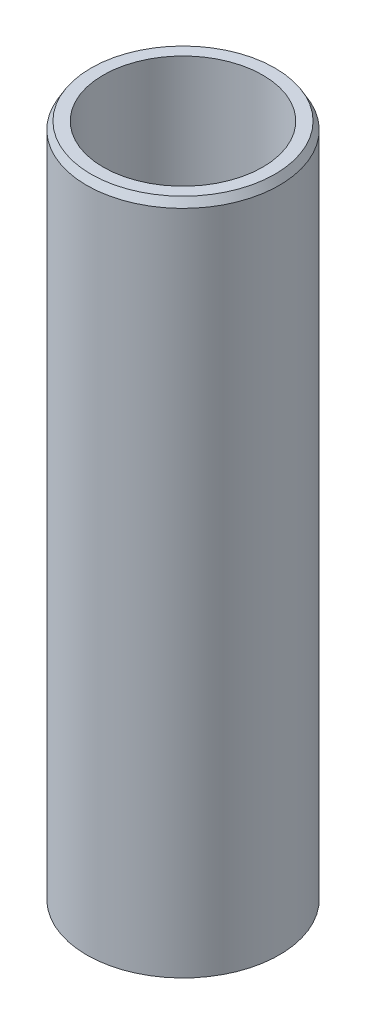
ISO-10303-21;
HEADER;
FILE_DESCRIPTION(('STEP AP214'),'2;1');
FILE_NAME('part.step','',(''),(''),'','','');
FILE_SCHEMA(('AUTOMOTIVE_DESIGN { 1 0 10303 214 1 1 1 1 }'));
ENDSEC;
DATA;
#1=APPLICATION_CONTEXT('core data for automotive mechanical design processes');
#2=APPLICATION_PROTOCOL_DEFINITION('international standard','automotive_design',2000,#1);
#3=PRODUCT_CONTEXT('',#1,'mechanical');
#4=PRODUCT('Part','Part','',(#3));
#5=PRODUCT_RELATED_PRODUCT_CATEGORY('part','',(#4));
#6=PRODUCT_DEFINITION_FORMATION('','',#4);
#7=PRODUCT_DEFINITION_CONTEXT('part definition',#1,'design');
#8=PRODUCT_DEFINITION('design','',#6,#7);
#9=PRODUCT_DEFINITION_SHAPE('','',#8);
#10=(LENGTH_UNIT() NAMED_UNIT(*) SI_UNIT(.MILLI.,.METRE.));
#11=(NAMED_UNIT(*) PLANE_ANGLE_UNIT() SI_UNIT($,.RADIAN.));
#12=(NAMED_UNIT(*) SI_UNIT($,.STERADIAN.) SOLID_ANGLE_UNIT());
#13=UNCERTAINTY_MEASURE_WITH_UNIT(LENGTH_MEASURE(1.E-05),#10,'distance_accuracy_value','');
#14=(GEOMETRIC_REPRESENTATION_CONTEXT(3) GLOBAL_UNCERTAINTY_ASSIGNED_CONTEXT((#13)) GLOBAL_UNIT_ASSIGNED_CONTEXT((#10,
#11,#12)) REPRESENTATION_CONTEXT('',''));
#15=CARTESIAN_POINT('',(0.,0.,0.));
#16=DIRECTION('',(0.,0.,1.));
#17=DIRECTION('',(1.,0.,0.));
#18=AXIS2_PLACEMENT_3D('',#15,#16,#17);
#19=CARTESIAN_POINT('',(0.,404.954098009164,0.));
#20=DIRECTION('',(0.,-1.,0.));
#21=DIRECTION('',(0.,0.,-1.));
#22=AXIS2_PLACEMENT_3D('',#19,#20,#21);
#23=CYLINDRICAL_SURFACE('',#22,57.5);
#24=CARTESIAN_POINT('',(0.,400.478846971104,0.));
#25=DIRECTION('',(0.,1.,0.));
#26=DIRECTION('',(0.,0.,1.));
#27=AXIS2_PLACEMENT_3D('',#24,#25,#26);
#28=CIRCLE('',#27,57.5);
#29=CARTESIAN_POINT('',(0.,400.478846971104,57.5));
#30=VERTEX_POINT('',#29);
#31=EDGE_CURVE('E50',#30,#30,#28,.F.);
#32=ORIENTED_EDGE('',*,*,#31,.T.);
#33=EDGE_LOOP('',(#32));
#34=FACE_BOUND('',#33,.T.);
#35=CARTESIAN_POINT('',(0.,2.58378739151521,0.));
#36=DIRECTION('',(0.,1.,0.));
#37=DIRECTION('',(0.,0.,1.));
#38=AXIS2_PLACEMENT_3D('',#35,#36,#37);
#39=CIRCLE('',#38,57.5);
#40=CARTESIAN_POINT('',(0.,2.58378739151521,57.5));
#41=VERTEX_POINT('',#40);
#42=EDGE_CURVE('E51',#41,#41,#39,.T.);
#43=ORIENTED_EDGE('',*,*,#42,.T.);
#44=EDGE_LOOP('',(#43));
#45=FACE_BOUND('',#44,.T.);
#46=ADVANCED_FACE('F39',(#34,#45),#23,.T.);
#47=CARTESIAN_POINT('',(0.,404.954098009164,0.));
#48=DIRECTION('',(0.,1.,0.));
#49=DIRECTION('',(0.,0.,1.));
#50=AXIS2_PLACEMENT_3D('',#47,#48,#49);
#51=PLANE('',#50);
#52=CARTESIAN_POINT('',(0.,404.954098009164,0.));
#53=DIRECTION('',(0.,1.,0.));
#54=DIRECTION('',(0.,0.,1.));
#55=AXIS2_PLACEMENT_3D('',#52,#53,#54);
#56=CIRCLE('',#55,54.9162126084848);
#57=CARTESIAN_POINT('',(0.,404.954098009164,54.9162126084848));
#58=VERTEX_POINT('',#57);
#59=EDGE_CURVE('E54',#58,#58,#56,.T.);
#60=ORIENTED_EDGE('',*,*,#59,.T.);
#61=EDGE_LOOP('',(#60));
#62=FACE_BOUND('',#61,.T.);
#63=CARTESIAN_POINT('',(0.,404.954098009164,0.));
#64=DIRECTION('',(0.,1.,0.));
#65=DIRECTION('',(0.,0.,1.));
#66=AXIS2_PLACEMENT_3D('',#63,#64,#65);
#67=CIRCLE('',#66,47.6275002703114);
#68=CARTESIAN_POINT('',(0.,404.954098009164,47.6275002703114));
#69=VERTEX_POINT('',#68);
#70=EDGE_CURVE('E58',#69,#69,#67,.T.);
#71=ORIENTED_EDGE('',*,*,#70,.F.);
#72=EDGE_LOOP('',(#71));
#73=FACE_BOUND('',#72,.T.);
#74=ADVANCED_FACE('F69',(#62,#73),#51,.T.);
#75=CARTESIAN_POINT('',(0.,0.,0.));
#76=DIRECTION('',(0.,1.,0.));
#77=DIRECTION('',(0.,0.,1.));
#78=AXIS2_PLACEMENT_3D('',#75,#76,#77);
#79=PLANE('',#78);
#80=CARTESIAN_POINT('',(0.,0.,0.));
#81=DIRECTION('',(0.,1.,0.));
#82=DIRECTION('',(0.,0.,1.));
#83=AXIS2_PLACEMENT_3D('',#80,#81,#82);
#84=CIRCLE('',#83,53.0247489619398);
#85=CARTESIAN_POINT('',(0.,0.,53.0247489619398));
#86=VERTEX_POINT('',#85);
#87=EDGE_CURVE('E10',#86,#86,#84,.F.);
#88=ORIENTED_EDGE('',*,*,#87,.T.);
#89=EDGE_LOOP('',(#88));
#90=FACE_BOUND('',#89,.T.);
#91=CARTESIAN_POINT('',(0.,0.,0.));
#92=DIRECTION('',(0.,1.,0.));
#93=DIRECTION('',(0.,0.,1.));
#94=AXIS2_PLACEMENT_3D('',#91,#92,#93);
#95=CIRCLE('',#94,47.6275002703114);
#96=CARTESIAN_POINT('',(0.,0.,47.6275002703114));
#97=VERTEX_POINT('',#96);
#98=EDGE_CURVE('E63',#97,#97,#95,.T.);
#99=ORIENTED_EDGE('',*,*,#98,.T.);
#100=EDGE_LOOP('',(#99));
#101=FACE_BOUND('',#100,.T.);
#102=ADVANCED_FACE('F75',(#90,#101),#79,.F.);
#103=CARTESIAN_POINT('',(0.,404.954098009164,0.));
#104=DIRECTION('',(0.,-1.,0.));
#105=DIRECTION('',(0.,0.,-1.));
#106=AXIS2_PLACEMENT_3D('',#103,#104,#105);
#107=CYLINDRICAL_SURFACE('',#106,47.6275002703114);
#108=ORIENTED_EDGE('',*,*,#70,.T.);
#109=EDGE_LOOP('',(#108));
#110=FACE_BOUND('',#109,.T.);
#111=ORIENTED_EDGE('',*,*,#98,.F.);
#112=EDGE_LOOP('',(#111));
#113=FACE_BOUND('',#112,.T.);
#114=ADVANCED_FACE('F70',(#110,#113),#107,.F.);
#115=CARTESIAN_POINT('',(0.,404.954098009164,0.));
#116=DIRECTION('',(0.,-1.,0.));
#117=DIRECTION('',(0.,0.,-1.));
#118=AXIS2_PLACEMENT_3D('',#115,#116,#117);
#119=CONICAL_SURFACE('',#118,54.9162126084848,0.523598775598293);
#120=ORIENTED_EDGE('',*,*,#31,.F.);
#121=EDGE_LOOP('',(#120));
#122=FACE_BOUND('',#121,.T.);
#123=ORIENTED_EDGE('',*,*,#59,.F.);
#124=EDGE_LOOP('',(#123));
#125=FACE_BOUND('',#124,.T.);
#126=ADVANCED_FACE('F81',(#122,#125),#119,.T.);
#127=CARTESIAN_POINT('',(0.,2.58378739151521,0.));
#128=DIRECTION('',(0.,1.,0.));
#129=DIRECTION('',(0.,0.,1.));
#130=AXIS2_PLACEMENT_3D('',#127,#128,#129);
#131=CONICAL_SURFACE('',#130,57.5,1.0471975511966);
#132=ORIENTED_EDGE('',*,*,#87,.F.);
#133=EDGE_LOOP('',(#132));
#134=FACE_BOUND('',#133,.T.);
#135=ORIENTED_EDGE('',*,*,#42,.F.);
#136=EDGE_LOOP('',(#135));
#137=FACE_BOUND('',#136,.T.);
#138=ADVANCED_FACE('F45',(#134,#137),#131,.T.);
#139=CLOSED_SHELL('',(#46,#74,#102,#114,#126,#138));
#140=MANIFOLD_SOLID_BREP('B2',#139);
#141=ADVANCED_BREP_SHAPE_REPRESENTATION('',(#18,#140),#14);
#142=SHAPE_DEFINITION_REPRESENTATION(#9,#141);
ENDSEC;
END-ISO-10303-21;
